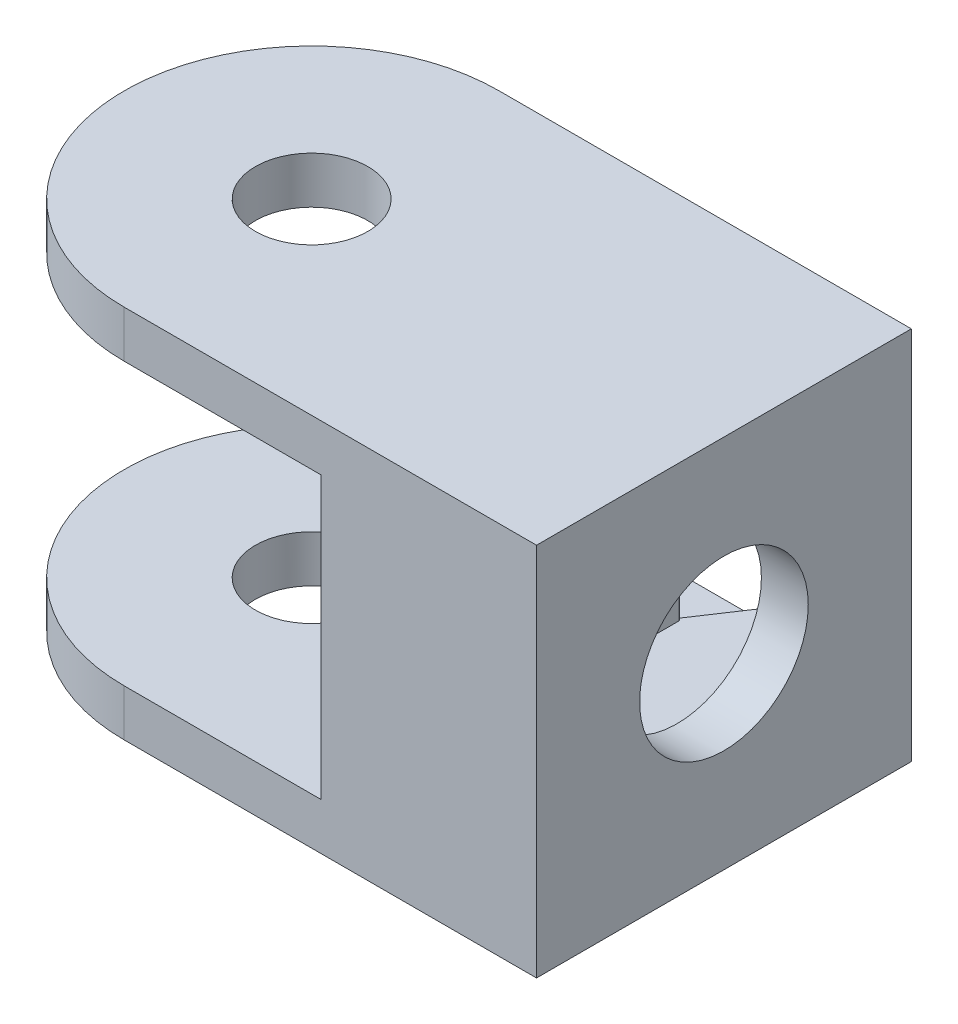
ISO-10303-21;
HEADER;
FILE_DESCRIPTION(('STEP AP214'),'2;1');
FILE_NAME('part.step','',(''),(''),'','','');
FILE_SCHEMA(('AUTOMOTIVE_DESIGN { 1 0 10303 214 1 1 1 1 }'));
ENDSEC;
DATA;
#1=APPLICATION_CONTEXT('core data for automotive mechanical design processes');
#2=APPLICATION_PROTOCOL_DEFINITION('international standard','automotive_design',2000,#1);
#3=PRODUCT_CONTEXT('',#1,'mechanical');
#4=PRODUCT('Part','Part','',(#3));
#5=PRODUCT_RELATED_PRODUCT_CATEGORY('part','',(#4));
#6=PRODUCT_DEFINITION_FORMATION('','',#4);
#7=PRODUCT_DEFINITION_CONTEXT('part definition',#1,'design');
#8=PRODUCT_DEFINITION('design','',#6,#7);
#9=PRODUCT_DEFINITION_SHAPE('','',#8);
#10=(LENGTH_UNIT() NAMED_UNIT(*) SI_UNIT(.MILLI.,.METRE.));
#11=(NAMED_UNIT(*) PLANE_ANGLE_UNIT() SI_UNIT($,.RADIAN.));
#12=(NAMED_UNIT(*) SI_UNIT($,.STERADIAN.) SOLID_ANGLE_UNIT());
#13=UNCERTAINTY_MEASURE_WITH_UNIT(LENGTH_MEASURE(1.E-05),#10,'distance_accuracy_value','');
#14=(GEOMETRIC_REPRESENTATION_CONTEXT(3) GLOBAL_UNCERTAINTY_ASSIGNED_CONTEXT((#13)) GLOBAL_UNIT_ASSIGNED_CONTEXT((#10,
#11,#12)) REPRESENTATION_CONTEXT('',''));
#15=CARTESIAN_POINT('',(0.,0.,0.));
#16=DIRECTION('',(0.,0.,1.));
#17=DIRECTION('',(1.,0.,0.));
#18=AXIS2_PLACEMENT_3D('',#15,#16,#17);
#19=CARTESIAN_POINT('',(-11.,20.,0.));
#20=DIRECTION('',(0.,-1.,0.));
#21=DIRECTION('',(0.,0.,-1.));
#22=AXIS2_PLACEMENT_3D('',#19,#20,#21);
#23=CYLINDRICAL_SURFACE('',#22,10.);
#24=DIRECTION('',(0.,-1.,0.));
#25=VECTOR('',#24,1.);
#26=CARTESIAN_POINT('',(-11.,20.,-10.));
#27=LINE('',#26,#25);
#28=CARTESIAN_POINT('',(-11.,20.,-10.));
#29=VERTEX_POINT('',#28);
#30=CARTESIAN_POINT('',(-11.,17.5,-10.));
#31=VERTEX_POINT('',#30);
#32=EDGE_CURVE('E268',#29,#31,#27,.T.);
#33=ORIENTED_EDGE('',*,*,#32,.T.);
#34=CARTESIAN_POINT('',(-11.,17.5,0.));
#35=DIRECTION('',(0.,1.,0.));
#36=DIRECTION('',(0.,0.,1.));
#37=AXIS2_PLACEMENT_3D('',#34,#35,#36);
#38=CIRCLE('',#37,10.);
#39=CARTESIAN_POINT('',(-11.,17.5,10.));
#40=VERTEX_POINT('',#39);
#41=EDGE_CURVE('E153',#31,#40,#38,.T.);
#42=ORIENTED_EDGE('',*,*,#41,.T.);
#43=DIRECTION('',(0.,-1.,0.));
#44=VECTOR('',#43,1.);
#45=CARTESIAN_POINT('',(-11.,20.,10.));
#46=LINE('',#45,#44);
#47=CARTESIAN_POINT('',(-11.,20.,10.));
#48=VERTEX_POINT('',#47);
#49=EDGE_CURVE('E264',#48,#40,#46,.T.);
#50=ORIENTED_EDGE('',*,*,#49,.F.);
#51=CARTESIAN_POINT('',(-11.,20.,0.));
#52=DIRECTION('',(0.,1.,0.));
#53=DIRECTION('',(0.,0.,1.));
#54=AXIS2_PLACEMENT_3D('',#51,#52,#53);
#55=CIRCLE('',#54,10.);
#56=EDGE_CURVE('E247',#29,#48,#55,.T.);
#57=ORIENTED_EDGE('',*,*,#56,.F.);
#58=EDGE_LOOP('',(#33,#42,#50,#57));
#59=FACE_BOUND('',#58,.T.);
#60=ADVANCED_FACE('F41',(#59),#23,.T.);
#61=CARTESIAN_POINT('',(-11.,20.,0.));
#62=DIRECTION('',(0.,-1.,0.));
#63=DIRECTION('',(0.,0.,-1.));
#64=AXIS2_PLACEMENT_3D('',#61,#62,#63);
#65=CYLINDRICAL_SURFACE('',#64,3.);
#66=CARTESIAN_POINT('',(-11.,17.5,0.));
#67=DIRECTION('',(0.,1.,0.));
#68=DIRECTION('',(0.,0.,1.));
#69=AXIS2_PLACEMENT_3D('',#66,#67,#68);
#70=CIRCLE('',#69,3.);
#71=CARTESIAN_POINT('',(-11.,17.5,3.));
#72=VERTEX_POINT('',#71);
#73=EDGE_CURVE('E197',#72,#72,#70,.T.);
#74=ORIENTED_EDGE('',*,*,#73,.F.);
#75=EDGE_LOOP('',(#74));
#76=FACE_BOUND('',#75,.T.);
#77=CARTESIAN_POINT('',(-11.,20.,0.));
#78=DIRECTION('',(0.,1.,0.));
#79=DIRECTION('',(0.,0.,1.));
#80=AXIS2_PLACEMENT_3D('',#77,#78,#79);
#81=CIRCLE('',#80,3.);
#82=CARTESIAN_POINT('',(-11.,20.,3.));
#83=VERTEX_POINT('',#82);
#84=EDGE_CURVE('E235',#83,#83,#81,.T.);
#85=ORIENTED_EDGE('',*,*,#84,.T.);
#86=EDGE_LOOP('',(#85));
#87=FACE_BOUND('',#86,.T.);
#88=ADVANCED_FACE('F311',(#76,#87),#65,.F.);
#89=CARTESIAN_POINT('',(-11.,20.,0.));
#90=DIRECTION('',(0.,1.,0.));
#91=DIRECTION('',(0.,0.,1.));
#92=AXIS2_PLACEMENT_3D('',#89,#90,#91);
#93=PLANE('',#92);
#94=DIRECTION('',(0.,0.,-1.));
#95=VECTOR('',#94,1.);
#96=CARTESIAN_POINT('',(11.,20.,10.));
#97=LINE('',#96,#95);
#98=CARTESIAN_POINT('',(11.,20.,10.));
#99=VERTEX_POINT('',#98);
#100=CARTESIAN_POINT('',(11.,20.,-10.));
#101=VERTEX_POINT('',#100);
#102=EDGE_CURVE('E241',#99,#101,#97,.T.);
#103=ORIENTED_EDGE('',*,*,#102,.T.);
#104=DIRECTION('',(-1.,0.,0.));
#105=VECTOR('',#104,1.);
#106=CARTESIAN_POINT('',(-11.,20.,-10.));
#107=LINE('',#106,#105);
#108=EDGE_CURVE('E244',#101,#29,#107,.T.);
#109=ORIENTED_EDGE('',*,*,#108,.T.);
#110=ORIENTED_EDGE('',*,*,#56,.T.);
#111=DIRECTION('',(1.,0.,0.));
#112=VECTOR('',#111,1.);
#113=CARTESIAN_POINT('',(-11.,20.,10.));
#114=LINE('',#113,#112);
#115=EDGE_CURVE('E249',#48,#99,#114,.T.);
#116=ORIENTED_EDGE('',*,*,#115,.T.);
#117=EDGE_LOOP('',(#103,#109,#110,#116));
#118=FACE_BOUND('',#117,.T.);
#119=ORIENTED_EDGE('',*,*,#84,.F.);
#120=EDGE_LOOP('',(#119));
#121=FACE_BOUND('',#120,.T.);
#122=ADVANCED_FACE('F318',(#118,#121),#93,.T.);
#123=CARTESIAN_POINT('',(-11.,0.,0.));
#124=DIRECTION('',(0.,1.,0.));
#125=DIRECTION('',(0.,0.,1.));
#126=AXIS2_PLACEMENT_3D('',#123,#124,#125);
#127=PLANE('',#126);
#128=DIRECTION('',(0.,0.,-1.));
#129=VECTOR('',#128,1.);
#130=CARTESIAN_POINT('',(11.,0.,10.));
#131=LINE('',#130,#129);
#132=CARTESIAN_POINT('',(11.,0.,10.));
#133=VERTEX_POINT('',#132);
#134=CARTESIAN_POINT('',(11.,0.,-10.));
#135=VERTEX_POINT('',#134);
#136=EDGE_CURVE('E238',#133,#135,#131,.T.);
#137=ORIENTED_EDGE('',*,*,#136,.F.);
#138=DIRECTION('',(1.,0.,0.));
#139=VECTOR('',#138,1.);
#140=CARTESIAN_POINT('',(-11.,0.,10.));
#141=LINE('',#140,#139);
#142=CARTESIAN_POINT('',(-11.,0.,10.));
#143=VERTEX_POINT('',#142);
#144=EDGE_CURVE('E245',#143,#133,#141,.T.);
#145=ORIENTED_EDGE('',*,*,#144,.F.);
#146=CARTESIAN_POINT('',(-11.,0.,0.));
#147=DIRECTION('',(0.,1.,0.));
#148=DIRECTION('',(0.,0.,1.));
#149=AXIS2_PLACEMENT_3D('',#146,#147,#148);
#150=CIRCLE('',#149,10.);
#151=CARTESIAN_POINT('',(-11.,0.,-10.));
#152=VERTEX_POINT('',#151);
#153=EDGE_CURVE('E257',#152,#143,#150,.T.);
#154=ORIENTED_EDGE('',*,*,#153,.F.);
#155=DIRECTION('',(-1.,0.,0.));
#156=VECTOR('',#155,1.);
#157=CARTESIAN_POINT('',(-11.,0.,-10.));
#158=LINE('',#157,#156);
#159=EDGE_CURVE('E254',#135,#152,#158,.T.);
#160=ORIENTED_EDGE('',*,*,#159,.F.);
#161=EDGE_LOOP('',(#137,#145,#154,#160));
#162=FACE_BOUND('',#161,.T.);
#163=CARTESIAN_POINT('',(-11.,0.,0.));
#164=DIRECTION('',(0.,1.,0.));
#165=DIRECTION('',(0.,0.,1.));
#166=AXIS2_PLACEMENT_3D('',#163,#164,#165);
#167=CIRCLE('',#166,3.);
#168=CARTESIAN_POINT('',(-11.,0.,3.));
#169=VERTEX_POINT('',#168);
#170=EDGE_CURVE('E226',#169,#169,#167,.T.);
#171=ORIENTED_EDGE('',*,*,#170,.T.);
#172=EDGE_LOOP('',(#171));
#173=FACE_BOUND('',#172,.T.);
#174=ADVANCED_FACE('F353',(#162,#173),#127,.F.);
#175=CARTESIAN_POINT('',(11.,20.,10.));
#176=DIRECTION('',(-1.,0.,0.));
#177=DIRECTION('',(0.,0.,1.));
#178=AXIS2_PLACEMENT_3D('',#175,#176,#177);
#179=PLANE('',#178);
#180=CARTESIAN_POINT('',(11.,10.,0.));
#181=DIRECTION('',(1.,0.,0.));
#182=DIRECTION('',(0.,0.,-1.));
#183=AXIS2_PLACEMENT_3D('',#180,#181,#182);
#184=CIRCLE('',#183,4.5);
#185=CARTESIAN_POINT('',(11.,10.,-4.5));
#186=VERTEX_POINT('',#185);
#187=EDGE_CURVE('E199',#186,#186,#184,.T.);
#188=ORIENTED_EDGE('',*,*,#187,.F.);
#189=EDGE_LOOP('',(#188));
#190=FACE_BOUND('',#189,.T.);
#191=ORIENTED_EDGE('',*,*,#136,.T.);
#192=DIRECTION('',(0.,-1.,0.));
#193=VECTOR('',#192,1.);
#194=CARTESIAN_POINT('',(11.,20.,-10.));
#195=LINE('',#194,#193);
#196=EDGE_CURVE('E270',#101,#135,#195,.T.);
#197=ORIENTED_EDGE('',*,*,#196,.F.);
#198=ORIENTED_EDGE('',*,*,#102,.F.);
#199=DIRECTION('',(0.,-1.,0.));
#200=VECTOR('',#199,1.);
#201=CARTESIAN_POINT('',(11.,20.,10.));
#202=LINE('',#201,#200);
#203=EDGE_CURVE('E251',#99,#133,#202,.T.);
#204=ORIENTED_EDGE('',*,*,#203,.T.);
#205=EDGE_LOOP('',(#191,#197,#198,#204));
#206=FACE_BOUND('',#205,.T.);
#207=ADVANCED_FACE('F332',(#190,#206),#179,.F.);
#208=CARTESIAN_POINT('',(-11.,20.,-10.));
#209=DIRECTION('',(0.,0.,1.));
#210=DIRECTION('',(1.,0.,0.));
#211=AXIS2_PLACEMENT_3D('',#208,#209,#210);
#212=PLANE('',#211);
#213=DIRECTION('',(1.,0.,0.));
#214=VECTOR('',#213,1.);
#215=CARTESIAN_POINT('',(8.5,16.8,-10.));
#216=LINE('',#215,#214);
#217=CARTESIAN_POINT('',(3.21505879842836,16.8,-10.));
#218=VERTEX_POINT('',#217);
#219=CARTESIAN_POINT('',(8.5,16.8,-10.));
#220=VERTEX_POINT('',#219);
#221=EDGE_CURVE('E171',#218,#220,#216,.T.);
#222=ORIENTED_EDGE('',*,*,#221,.F.);
#223=DIRECTION('',(0.,-1.,0.));
#224=VECTOR('',#223,1.);
#225=CARTESIAN_POINT('',(3.21505879842836,17.5,-10.));
#226=LINE('',#225,#224);
#227=CARTESIAN_POINT('',(3.21505879842836,17.5,-10.));
#228=VERTEX_POINT('',#227);
#229=EDGE_CURVE('E162',#228,#218,#226,.T.);
#230=ORIENTED_EDGE('',*,*,#229,.F.);
#231=DIRECTION('',(1.,0.,0.));
#232=VECTOR('',#231,1.);
#233=CARTESIAN_POINT('',(-21.5,17.5,-10.));
#234=LINE('',#233,#232);
#235=EDGE_CURVE('E147',#31,#228,#234,.T.);
#236=ORIENTED_EDGE('',*,*,#235,.F.);
#237=ORIENTED_EDGE('',*,*,#32,.F.);
#238=ORIENTED_EDGE('',*,*,#108,.F.);
#239=ORIENTED_EDGE('',*,*,#196,.T.);
#240=ORIENTED_EDGE('',*,*,#159,.T.);
#241=CARTESIAN_POINT('',(-11.,2.5,-10.));
#242=VERTEX_POINT('',#241);
#243=EDGE_CURVE('E267',#242,#152,#27,.T.);
#244=ORIENTED_EDGE('',*,*,#243,.F.);
#245=DIRECTION('',(1.,0.,0.));
#246=VECTOR('',#245,1.);
#247=CARTESIAN_POINT('',(-21.5,2.5,-10.));
#248=LINE('',#247,#246);
#249=CARTESIAN_POINT('',(3.21505879842836,2.5,-10.));
#250=VERTEX_POINT('',#249);
#251=EDGE_CURVE('E159',#242,#250,#248,.T.);
#252=ORIENTED_EDGE('',*,*,#251,.T.);
#253=CARTESIAN_POINT('',(3.21505879842836,3.2,-10.));
#254=VERTEX_POINT('',#253);
#255=EDGE_CURVE('E165',#254,#250,#226,.T.);
#256=ORIENTED_EDGE('',*,*,#255,.F.);
#257=DIRECTION('',(-1.,0.,0.));
#258=VECTOR('',#257,1.);
#259=CARTESIAN_POINT('',(8.5,3.2,-10.));
#260=LINE('',#259,#258);
#261=CARTESIAN_POINT('',(8.5,3.2,-10.));
#262=VERTEX_POINT('',#261);
#263=EDGE_CURVE('E220',#262,#254,#260,.T.);
#264=ORIENTED_EDGE('',*,*,#263,.F.);
#265=DIRECTION('',(0.,-1.,0.));
#266=VECTOR('',#265,1.);
#267=CARTESIAN_POINT('',(8.5,16.8,-10.));
#268=LINE('',#267,#266);
#269=EDGE_CURVE('E205',#220,#262,#268,.T.);
#270=ORIENTED_EDGE('',*,*,#269,.F.);
#271=EDGE_LOOP('',(#222,#230,#236,#237,#238,#239,#240,#244,#252,#256,#264,#270));
#272=FACE_BOUND('',#271,.T.);
#273=ADVANCED_FACE('F169',(#272),#212,.F.);
#274=CARTESIAN_POINT('',(-11.,2.5,10.));
#275=VERTEX_POINT('',#274);
#276=EDGE_CURVE('E263',#275,#143,#46,.T.);
#277=ORIENTED_EDGE('',*,*,#276,.F.);
#278=CARTESIAN_POINT('',(-11.,2.5,0.));
#279=DIRECTION('',(0.,-1.,0.));
#280=DIRECTION('',(0.,0.,-1.));
#281=AXIS2_PLACEMENT_3D('',#278,#279,#280);
#282=CIRCLE('',#281,10.);
#283=EDGE_CURVE('E194',#275,#242,#282,.T.);
#284=ORIENTED_EDGE('',*,*,#283,.T.);
#285=ORIENTED_EDGE('',*,*,#243,.T.);
#286=ORIENTED_EDGE('',*,*,#153,.T.);
#287=EDGE_LOOP('',(#277,#284,#285,#286));
#288=FACE_BOUND('',#287,.T.);
#289=ADVANCED_FACE('F314',(#288),#23,.T.);
#290=CARTESIAN_POINT('',(-11.,20.,10.));
#291=DIRECTION('',(0.,0.,-1.));
#292=DIRECTION('',(-1.,0.,0.));
#293=AXIS2_PLACEMENT_3D('',#290,#291,#292);
#294=PLANE('',#293);
#295=ORIENTED_EDGE('',*,*,#49,.T.);
#296=DIRECTION('',(1.,0.,0.));
#297=VECTOR('',#296,1.);
#298=CARTESIAN_POINT('',(-21.5,17.5,10.));
#299=LINE('',#298,#297);
#300=CARTESIAN_POINT('',(-0.499999999999999,17.5,10.));
#301=VERTEX_POINT('',#300);
#302=EDGE_CURVE('E186',#40,#301,#299,.T.);
#303=ORIENTED_EDGE('',*,*,#302,.T.);
#304=DIRECTION('',(0.,-1.,0.));
#305=VECTOR('',#304,1.);
#306=CARTESIAN_POINT('',(-0.499999999999999,17.5,10.));
#307=LINE('',#306,#305);
#308=CARTESIAN_POINT('',(-0.499999999999999,2.5,10.));
#309=VERTEX_POINT('',#308);
#310=EDGE_CURVE('E181',#301,#309,#307,.T.);
#311=ORIENTED_EDGE('',*,*,#310,.T.);
#312=DIRECTION('',(1.,0.,0.));
#313=VECTOR('',#312,1.);
#314=CARTESIAN_POINT('',(-21.5,2.5,10.));
#315=LINE('',#314,#313);
#316=EDGE_CURVE('E189',#275,#309,#315,.T.);
#317=ORIENTED_EDGE('',*,*,#316,.F.);
#318=ORIENTED_EDGE('',*,*,#276,.T.);
#319=ORIENTED_EDGE('',*,*,#144,.T.);
#320=ORIENTED_EDGE('',*,*,#203,.F.);
#321=ORIENTED_EDGE('',*,*,#115,.F.);
#322=EDGE_LOOP('',(#295,#303,#311,#317,#318,#319,#320,#321));
#323=FACE_BOUND('',#322,.T.);
#324=ADVANCED_FACE('F325',(#323),#294,.F.);
#325=CARTESIAN_POINT('',(-11.,2.5,0.));
#326=DIRECTION('',(0.,-1.,0.));
#327=DIRECTION('',(0.,0.,-1.));
#328=AXIS2_PLACEMENT_3D('',#325,#326,#327);
#329=CIRCLE('',#328,3.);
#330=CARTESIAN_POINT('',(-11.,2.5,-3.));
#331=VERTEX_POINT('',#330);
#332=EDGE_CURVE('E158',#331,#331,#329,.T.);
#333=ORIENTED_EDGE('',*,*,#332,.F.);
#334=EDGE_LOOP('',(#333));
#335=FACE_BOUND('',#334,.T.);
#336=ORIENTED_EDGE('',*,*,#170,.F.);
#337=EDGE_LOOP('',(#336));
#338=FACE_BOUND('',#337,.T.);
#339=ADVANCED_FACE('F321',(#335,#338),#65,.F.);
#340=CARTESIAN_POINT('',(8.5,16.8,7.));
#341=DIRECTION('',(1.,0.,0.));
#342=DIRECTION('',(0.,0.,-1.));
#343=AXIS2_PLACEMENT_3D('',#340,#341,#342);
#344=PLANE('',#343);
#345=CARTESIAN_POINT('',(8.5,10.,0.));
#346=DIRECTION('',(1.,0.,0.));
#347=DIRECTION('',(0.,0.,-1.));
#348=AXIS2_PLACEMENT_3D('',#345,#346,#347);
#349=CIRCLE('',#348,4.5);
#350=CARTESIAN_POINT('',(8.5,10.,-4.5));
#351=VERTEX_POINT('',#350);
#352=EDGE_CURVE('E202',#351,#351,#349,.F.);
#353=ORIENTED_EDGE('',*,*,#352,.F.);
#354=EDGE_LOOP('',(#353));
#355=FACE_BOUND('',#354,.T.);
#356=ORIENTED_EDGE('',*,*,#269,.T.);
#357=DIRECTION('',(0.,0.,-1.));
#358=VECTOR('',#357,1.);
#359=CARTESIAN_POINT('',(8.5,3.2,7.));
#360=LINE('',#359,#358);
#361=CARTESIAN_POINT('',(8.5,3.2,7.));
#362=VERTEX_POINT('',#361);
#363=EDGE_CURVE('E218',#362,#262,#360,.T.);
#364=ORIENTED_EDGE('',*,*,#363,.F.);
#365=DIRECTION('',(0.,-1.,0.));
#366=VECTOR('',#365,1.);
#367=CARTESIAN_POINT('',(8.5,16.8,7.));
#368=LINE('',#367,#366);
#369=CARTESIAN_POINT('',(8.5,16.8,7.));
#370=VERTEX_POINT('',#369);
#371=EDGE_CURVE('E206',#370,#362,#368,.T.);
#372=ORIENTED_EDGE('',*,*,#371,.F.);
#373=DIRECTION('',(0.,0.,-1.));
#374=VECTOR('',#373,1.);
#375=CARTESIAN_POINT('',(8.5,16.8,7.));
#376=LINE('',#375,#374);
#377=EDGE_CURVE('E223',#370,#220,#376,.T.);
#378=ORIENTED_EDGE('',*,*,#377,.T.);
#379=EDGE_LOOP('',(#356,#364,#372,#378));
#380=FACE_BOUND('',#379,.T.);
#381=ADVANCED_FACE('F296',(#355,#380),#344,.F.);
#382=CARTESIAN_POINT('',(8.5,16.8,7.));
#383=DIRECTION('',(0.,1.,0.));
#384=DIRECTION('',(0.,0.,1.));
#385=AXIS2_PLACEMENT_3D('',#382,#383,#384);
#386=PLANE('',#385);
#387=DIRECTION('',(0.,0.,-1.));
#388=VECTOR('',#387,1.);
#389=CARTESIAN_POINT('',(1.5,16.8,7.));
#390=LINE('',#389,#388);
#391=CARTESIAN_POINT('',(1.5,16.8,7.));
#392=VERTEX_POINT('',#391);
#393=CARTESIAN_POINT('',(1.5,16.8,-7.08851135849692));
#394=VERTEX_POINT('',#393);
#395=EDGE_CURVE('E227',#392,#394,#390,.T.);
#396=ORIENTED_EDGE('',*,*,#395,.T.);
#397=CARTESIAN_POINT('',(1.4,16.8,-7.08851135849692));
#398=DIRECTION('',(0.,1.,0.));
#399=DIRECTION('',(0.,0.,1.));
#400=AXIS2_PLACEMENT_3D('',#397,#398,#399);
#401=CIRCLE('',#400,0.1);
#402=CARTESIAN_POINT('',(1.31671768518007,16.8,-7.14386527469292));
#403=VERTEX_POINT('',#402);
#404=EDGE_CURVE('E49',#394,#403,#401,.T.);
#405=ORIENTED_EDGE('',*,*,#404,.T.);
#406=DIRECTION('',(0.553539161960074,0.,-0.832823148199267));
#407=VECTOR('',#406,1.);
#408=CARTESIAN_POINT('',(-3.00260946929053,16.8,-0.645254361327675));
#409=LINE('',#408,#407);
#410=EDGE_CURVE('E56',#403,#218,#409,.T.);
#411=ORIENTED_EDGE('',*,*,#410,.T.);
#412=ORIENTED_EDGE('',*,*,#221,.T.);
#413=ORIENTED_EDGE('',*,*,#377,.F.);
#414=DIRECTION('',(1.,0.,0.));
#415=VECTOR('',#414,1.);
#416=CARTESIAN_POINT('',(8.5,16.8,7.));
#417=LINE('',#416,#415);
#418=EDGE_CURVE('E215',#392,#370,#417,.T.);
#419=ORIENTED_EDGE('',*,*,#418,.F.);
#420=EDGE_LOOP('',(#396,#405,#411,#412,#413,#419));
#421=FACE_BOUND('',#420,.T.);
#422=ADVANCED_FACE('F283',(#421),#386,.F.);
#423=CARTESIAN_POINT('',(1.5,16.8,7.));
#424=DIRECTION('',(-1.,0.,0.));
#425=DIRECTION('',(0.,-1.,0.));
#426=AXIS2_PLACEMENT_3D('',#423,#424,#425);
#427=PLANE('',#426);
#428=DIRECTION('',(0.,0.,-1.));
#429=VECTOR('',#428,1.);
#430=CARTESIAN_POINT('',(1.5,3.2,7.));
#431=LINE('',#430,#429);
#432=CARTESIAN_POINT('',(1.5,3.2,7.));
#433=VERTEX_POINT('',#432);
#434=CARTESIAN_POINT('',(1.5,3.2,-7.08851135849692));
#435=VERTEX_POINT('',#434);
#436=EDGE_CURVE('E230',#433,#435,#431,.T.);
#437=ORIENTED_EDGE('',*,*,#436,.T.);
#438=DIRECTION('',(0.,1.,0.));
#439=VECTOR('',#438,1.);
#440=CARTESIAN_POINT('',(1.5,16.8,-7.08851135849692));
#441=LINE('',#440,#439);
#442=EDGE_CURVE('E273',#435,#394,#441,.T.);
#443=ORIENTED_EDGE('',*,*,#442,.T.);
#444=ORIENTED_EDGE('',*,*,#395,.F.);
#445=DIRECTION('',(0.,1.,0.));
#446=VECTOR('',#445,1.);
#447=CARTESIAN_POINT('',(1.5,16.8,7.));
#448=LINE('',#447,#446);
#449=EDGE_CURVE('E212',#433,#392,#448,.T.);
#450=ORIENTED_EDGE('',*,*,#449,.F.);
#451=EDGE_LOOP('',(#437,#443,#444,#450));
#452=FACE_BOUND('',#451,.T.);
#453=ADVANCED_FACE('F301',(#452),#427,.F.);
#454=CARTESIAN_POINT('',(8.5,3.2,7.));
#455=DIRECTION('',(0.,-1.,0.));
#456=DIRECTION('',(1.,0.,0.));
#457=AXIS2_PLACEMENT_3D('',#454,#455,#456);
#458=PLANE('',#457);
#459=ORIENTED_EDGE('',*,*,#263,.T.);
#460=DIRECTION('',(-0.553539161960074,0.,0.832823148199267));
#461=VECTOR('',#460,1.);
#462=CARTESIAN_POINT('',(-3.00260946929053,3.2,-0.645254361327675));
#463=LINE('',#462,#461);
#464=CARTESIAN_POINT('',(1.31671768518007,3.2,-7.14386527469293));
#465=VERTEX_POINT('',#464);
#466=EDGE_CURVE('E63',#254,#465,#463,.T.);
#467=ORIENTED_EDGE('',*,*,#466,.T.);
#468=CARTESIAN_POINT('',(1.4,3.2,-7.08851135849692));
#469=DIRECTION('',(0.,-1.,0.));
#470=DIRECTION('',(1.,0.,0.));
#471=AXIS2_PLACEMENT_3D('',#468,#469,#470);
#472=CIRCLE('',#471,0.1);
#473=EDGE_CURVE('E11',#465,#435,#472,.T.);
#474=ORIENTED_EDGE('',*,*,#473,.T.);
#475=ORIENTED_EDGE('',*,*,#436,.F.);
#476=DIRECTION('',(-1.,0.,0.));
#477=VECTOR('',#476,1.);
#478=CARTESIAN_POINT('',(8.5,3.2,7.));
#479=LINE('',#478,#477);
#480=EDGE_CURVE('E209',#362,#433,#479,.T.);
#481=ORIENTED_EDGE('',*,*,#480,.F.);
#482=ORIENTED_EDGE('',*,*,#363,.T.);
#483=EDGE_LOOP('',(#459,#467,#474,#475,#481,#482));
#484=FACE_BOUND('',#483,.T.);
#485=ADVANCED_FACE('F292',(#484),#458,.F.);
#486=CARTESIAN_POINT('',(0.,0.,7.));
#487=DIRECTION('',(0.,0.,-1.));
#488=DIRECTION('',(-1.,0.,0.));
#489=AXIS2_PLACEMENT_3D('',#486,#487,#488);
#490=PLANE('',#489);
#491=ORIENTED_EDGE('',*,*,#371,.T.);
#492=ORIENTED_EDGE('',*,*,#480,.T.);
#493=ORIENTED_EDGE('',*,*,#449,.T.);
#494=ORIENTED_EDGE('',*,*,#418,.T.);
#495=EDGE_LOOP('',(#491,#492,#493,#494));
#496=FACE_BOUND('',#495,.T.);
#497=ADVANCED_FACE('F298',(#496),#490,.T.);
#498=CARTESIAN_POINT('',(-21.001,10.,0.));
#499=DIRECTION('',(1.,0.,0.));
#500=DIRECTION('',(0.,0.,-1.));
#501=AXIS2_PLACEMENT_3D('',#498,#499,#500);
#502=CYLINDRICAL_SURFACE('',#501,4.5);
#503=ORIENTED_EDGE('',*,*,#187,.T.);
#504=EDGE_LOOP('',(#503));
#505=FACE_BOUND('',#504,.T.);
#506=ORIENTED_EDGE('',*,*,#352,.T.);
#507=EDGE_LOOP('',(#506));
#508=FACE_BOUND('',#507,.T.);
#509=ADVANCED_FACE('F402',(#505,#508),#502,.F.);
#510=CARTESIAN_POINT('',(-21.5,17.5,-10.));
#511=DIRECTION('',(0.,1.,0.));
#512=DIRECTION('',(0.,0.,1.));
#513=AXIS2_PLACEMENT_3D('',#510,#511,#512);
#514=PLANE('',#513);
#515=ORIENTED_EDGE('',*,*,#73,.T.);
#516=EDGE_LOOP('',(#515));
#517=FACE_BOUND('',#516,.T.);
#518=ORIENTED_EDGE('',*,*,#235,.T.);
#519=DIRECTION('',(-0.553539161960074,0.,0.832823148199267));
#520=VECTOR('',#519,1.);
#521=CARTESIAN_POINT('',(3.21505879842836,17.5,-10.));
#522=LINE('',#521,#520);
#523=CARTESIAN_POINT('',(-0.499999999999999,17.5,-4.41053645907051));
#524=VERTEX_POINT('',#523);
#525=EDGE_CURVE('E150',#228,#524,#522,.T.);
#526=ORIENTED_EDGE('',*,*,#525,.T.);
#527=DIRECTION('',(0.,0.,1.));
#528=VECTOR('',#527,1.);
#529=CARTESIAN_POINT('',(-0.499999999999999,17.5,-10.));
#530=LINE('',#529,#528);
#531=EDGE_CURVE('E179',#524,#301,#530,.T.);
#532=ORIENTED_EDGE('',*,*,#531,.T.);
#533=ORIENTED_EDGE('',*,*,#302,.F.);
#534=ORIENTED_EDGE('',*,*,#41,.F.);
#535=EDGE_LOOP('',(#518,#526,#532,#533,#534));
#536=FACE_BOUND('',#535,.T.);
#537=ADVANCED_FACE('F149',(#517,#536),#514,.F.);
#538=CARTESIAN_POINT('',(-21.5,2.5,-10.));
#539=DIRECTION('',(0.,-1.,0.));
#540=DIRECTION('',(0.,0.,-1.));
#541=AXIS2_PLACEMENT_3D('',#538,#539,#540);
#542=PLANE('',#541);
#543=ORIENTED_EDGE('',*,*,#332,.T.);
#544=EDGE_LOOP('',(#543));
#545=FACE_BOUND('',#544,.T.);
#546=ORIENTED_EDGE('',*,*,#316,.T.);
#547=DIRECTION('',(0.,0.,-1.));
#548=VECTOR('',#547,1.);
#549=CARTESIAN_POINT('',(-0.499999999999999,2.5,-10.));
#550=LINE('',#549,#548);
#551=CARTESIAN_POINT('',(-0.499999999999999,2.5,-4.41053645907051));
#552=VERTEX_POINT('',#551);
#553=EDGE_CURVE('E184',#309,#552,#550,.T.);
#554=ORIENTED_EDGE('',*,*,#553,.T.);
#555=DIRECTION('',(-0.553539161960074,0.,0.832823148199267));
#556=VECTOR('',#555,1.);
#557=CARTESIAN_POINT('',(3.21505879842836,2.5,-10.));
#558=LINE('',#557,#556);
#559=EDGE_CURVE('E166',#250,#552,#558,.T.);
#560=ORIENTED_EDGE('',*,*,#559,.F.);
#561=ORIENTED_EDGE('',*,*,#251,.F.);
#562=ORIENTED_EDGE('',*,*,#283,.F.);
#563=EDGE_LOOP('',(#546,#554,#560,#561,#562));
#564=FACE_BOUND('',#563,.T.);
#565=ADVANCED_FACE('F340',(#545,#564),#542,.F.);
#566=CARTESIAN_POINT('',(-0.499999999999999,0.,0.));
#567=DIRECTION('',(1.,0.,0.));
#568=DIRECTION('',(0.,0.,-1.));
#569=AXIS2_PLACEMENT_3D('',#566,#567,#568);
#570=PLANE('',#569);
#571=ORIENTED_EDGE('',*,*,#531,.F.);
#572=DIRECTION('',(0.,-1.,0.));
#573=VECTOR('',#572,1.);
#574=CARTESIAN_POINT('',(-0.499999999999999,17.5,-4.41053645907051));
#575=LINE('',#574,#573);
#576=EDGE_CURVE('E164',#524,#552,#575,.T.);
#577=ORIENTED_EDGE('',*,*,#576,.T.);
#578=ORIENTED_EDGE('',*,*,#553,.F.);
#579=ORIENTED_EDGE('',*,*,#310,.F.);
#580=EDGE_LOOP('',(#571,#577,#578,#579));
#581=FACE_BOUND('',#580,.T.);
#582=ADVANCED_FACE('F342',(#581),#570,.F.);
#583=CARTESIAN_POINT('',(3.21505879842836,17.5,-10.));
#584=DIRECTION('',(0.832823148199267,0.,0.553539161960074));
#585=DIRECTION('',(0.553539161960074,0.,-0.832823148199267));
#586=AXIS2_PLACEMENT_3D('',#583,#584,#585);
#587=PLANE('',#586);
#588=ORIENTED_EDGE('',*,*,#410,.F.);
#589=DIRECTION('',(0.,1.,0.));
#590=VECTOR('',#589,1.);
#591=CARTESIAN_POINT('',(1.31671768518007,17.5,-7.14386527469292));
#592=LINE('',#591,#590);
#593=EDGE_CURVE('E280',#403,#465,#592,.F.);
#594=ORIENTED_EDGE('',*,*,#593,.T.);
#595=ORIENTED_EDGE('',*,*,#466,.F.);
#596=ORIENTED_EDGE('',*,*,#255,.T.);
#597=ORIENTED_EDGE('',*,*,#559,.T.);
#598=ORIENTED_EDGE('',*,*,#576,.F.);
#599=ORIENTED_EDGE('',*,*,#525,.F.);
#600=ORIENTED_EDGE('',*,*,#229,.T.);
#601=EDGE_LOOP('',(#588,#594,#595,#596,#597,#598,#599,#600));
#602=FACE_BOUND('',#601,.T.);
#603=ADVANCED_FACE('F161',(#602),#587,.F.);
#604=CARTESIAN_POINT('',(1.4,16.8,-7.08851135849692));
#605=DIRECTION('',(0.,1.,0.));
#606=DIRECTION('',(0.,0.,1.));
#607=AXIS2_PLACEMENT_3D('',#604,#605,#606);
#608=CYLINDRICAL_SURFACE('',#607,0.1);
#609=ORIENTED_EDGE('',*,*,#473,.F.);
#610=ORIENTED_EDGE('',*,*,#593,.F.);
#611=ORIENTED_EDGE('',*,*,#404,.F.);
#612=ORIENTED_EDGE('',*,*,#442,.F.);
#613=EDGE_LOOP('',(#609,#610,#611,#612));
#614=FACE_BOUND('',#613,.T.);
#615=ADVANCED_FACE('F43',(#614),#608,.T.);
#616=CLOSED_SHELL('',(#60,#88,#122,#174,#207,#273,#289,#324,#339,#381,#422,#453,#485,#497,#509,
#537,#565,#582,#603,#615));
#617=MANIFOLD_SOLID_BREP('B2',#616);
#618=ADVANCED_BREP_SHAPE_REPRESENTATION('',(#18,#617),#14);
#619=SHAPE_DEFINITION_REPRESENTATION(#9,#618);
ENDSEC;
END-ISO-10303-21;
